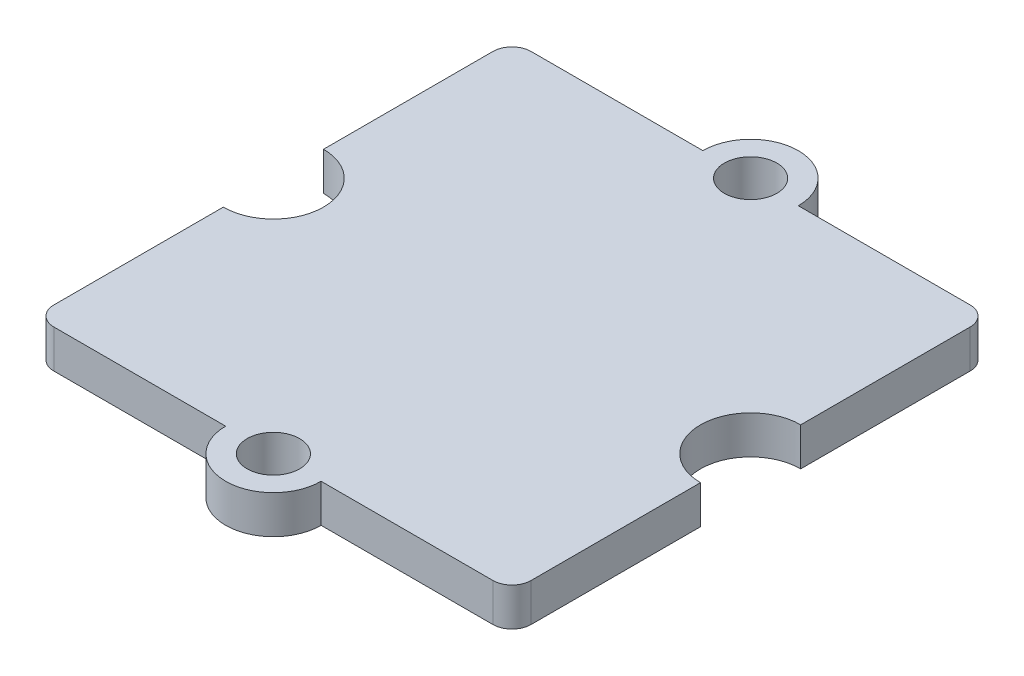
ISO-10303-21;
HEADER;
FILE_DESCRIPTION(('STEP AP214'),'2;1');
FILE_NAME('part.step','',(''),(''),'','','');
FILE_SCHEMA(('AUTOMOTIVE_DESIGN { 1 0 10303 214 1 1 1 1 }'));
ENDSEC;
DATA;
#1=APPLICATION_CONTEXT('core data for automotive mechanical design processes');
#2=APPLICATION_PROTOCOL_DEFINITION('international standard','automotive_design',2000,#1);
#3=PRODUCT_CONTEXT('',#1,'mechanical');
#4=PRODUCT('Part','Part','',(#3));
#5=PRODUCT_RELATED_PRODUCT_CATEGORY('part','',(#4));
#6=PRODUCT_DEFINITION_FORMATION('','',#4);
#7=PRODUCT_DEFINITION_CONTEXT('part definition',#1,'design');
#8=PRODUCT_DEFINITION('design','',#6,#7);
#9=PRODUCT_DEFINITION_SHAPE('','',#8);
#10=(LENGTH_UNIT() NAMED_UNIT(*) SI_UNIT(.MILLI.,.METRE.));
#11=(NAMED_UNIT(*) PLANE_ANGLE_UNIT() SI_UNIT($,.RADIAN.));
#12=(NAMED_UNIT(*) SI_UNIT($,.STERADIAN.) SOLID_ANGLE_UNIT());
#13=UNCERTAINTY_MEASURE_WITH_UNIT(LENGTH_MEASURE(1.E-05),#10,'distance_accuracy_value','');
#14=(GEOMETRIC_REPRESENTATION_CONTEXT(3) GLOBAL_UNCERTAINTY_ASSIGNED_CONTEXT((#13)) GLOBAL_UNIT_ASSIGNED_CONTEXT((#10,
#11,#12)) REPRESENTATION_CONTEXT('',''));
#15=CARTESIAN_POINT('',(0.,0.,0.));
#16=DIRECTION('',(0.,0.,1.));
#17=DIRECTION('',(1.,0.,0.));
#18=AXIS2_PLACEMENT_3D('',#15,#16,#17);
#19=CARTESIAN_POINT('',(0.,0.8,10.));
#20=DIRECTION('',(0.,-1.,0.));
#21=DIRECTION('',(0.,0.,-1.));
#22=AXIS2_PLACEMENT_3D('',#19,#20,#21);
#23=CYLINDRICAL_SURFACE('',#22,2.);
#24=CARTESIAN_POINT('',(0.,-0.8,10.));
#25=DIRECTION('',(0.,1.,0.));
#26=DIRECTION('',(0.,0.,1.));
#27=AXIS2_PLACEMENT_3D('',#24,#25,#26);
#28=CIRCLE('',#27,2.);
#29=CARTESIAN_POINT('',(-2.,-0.8,10.));
#30=VERTEX_POINT('',#29);
#31=CARTESIAN_POINT('',(2.,-0.8,10.));
#32=VERTEX_POINT('',#31);
#33=EDGE_CURVE('E191',#30,#32,#28,.T.);
#34=ORIENTED_EDGE('',*,*,#33,.T.);
#35=DIRECTION('',(0.,-1.,0.));
#36=VECTOR('',#35,1.);
#37=CARTESIAN_POINT('',(2.,0.8,10.));
#38=LINE('',#37,#36);
#39=CARTESIAN_POINT('',(2.,0.8,10.));
#40=VERTEX_POINT('',#39);
#41=EDGE_CURVE('E11',#40,#32,#38,.T.);
#42=ORIENTED_EDGE('',*,*,#41,.F.);
#43=CARTESIAN_POINT('',(0.,0.8,10.));
#44=DIRECTION('',(0.,1.,0.));
#45=DIRECTION('',(0.,0.,1.));
#46=AXIS2_PLACEMENT_3D('',#43,#44,#45);
#47=CIRCLE('',#46,2.);
#48=CARTESIAN_POINT('',(-2.,0.8,10.));
#49=VERTEX_POINT('',#48);
#50=EDGE_CURVE('E232',#49,#40,#47,.T.);
#51=ORIENTED_EDGE('',*,*,#50,.F.);
#52=DIRECTION('',(0.,-1.,0.));
#53=VECTOR('',#52,1.);
#54=CARTESIAN_POINT('',(-2.,0.8,10.));
#55=LINE('',#54,#53);
#56=EDGE_CURVE('E190',#49,#30,#55,.T.);
#57=ORIENTED_EDGE('',*,*,#56,.T.);
#58=EDGE_LOOP('',(#34,#42,#51,#57));
#59=FACE_BOUND('',#58,.T.);
#60=ADVANCED_FACE('F40',(#59),#23,.T.);
#61=CARTESIAN_POINT('',(0.,0.8,10.));
#62=DIRECTION('',(0.,0.,-1.));
#63=DIRECTION('',(-1.,0.,0.));
#64=AXIS2_PLACEMENT_3D('',#61,#62,#63);
#65=PLANE('',#64);
#66=DIRECTION('',(1.,0.,0.));
#67=VECTOR('',#66,1.);
#68=CARTESIAN_POINT('',(0.,-0.8,10.));
#69=LINE('',#68,#67);
#70=CARTESIAN_POINT('',(9.2,-0.8,10.));
#71=VERTEX_POINT('',#70);
#72=EDGE_CURVE('E194',#32,#71,#69,.T.);
#73=ORIENTED_EDGE('',*,*,#72,.T.);
#74=DIRECTION('',(0.,-1.,0.));
#75=VECTOR('',#74,1.);
#76=CARTESIAN_POINT('',(9.2,0.8,10.));
#77=LINE('',#76,#75);
#78=CARTESIAN_POINT('',(9.2,0.8,10.));
#79=VERTEX_POINT('',#78);
#80=EDGE_CURVE('E48',#79,#71,#77,.T.);
#81=ORIENTED_EDGE('',*,*,#80,.F.);
#82=DIRECTION('',(1.,0.,0.));
#83=VECTOR('',#82,1.);
#84=CARTESIAN_POINT('',(0.,0.8,10.));
#85=LINE('',#84,#83);
#86=EDGE_CURVE('E119',#40,#79,#85,.T.);
#87=ORIENTED_EDGE('',*,*,#86,.F.);
#88=ORIENTED_EDGE('',*,*,#41,.T.);
#89=EDGE_LOOP('',(#73,#81,#87,#88));
#90=FACE_BOUND('',#89,.T.);
#91=ADVANCED_FACE('F312',(#90),#65,.F.);
#92=CARTESIAN_POINT('',(9.2,0.8,9.2));
#93=DIRECTION('',(0.,-1.,0.));
#94=DIRECTION('',(0.,0.,-1.));
#95=AXIS2_PLACEMENT_3D('',#92,#93,#94);
#96=CYLINDRICAL_SURFACE('',#95,0.800000000000001);
#97=CARTESIAN_POINT('',(9.2,-0.8,9.2));
#98=DIRECTION('',(0.,1.,0.));
#99=DIRECTION('',(0.,0.,1.));
#100=AXIS2_PLACEMENT_3D('',#97,#98,#99);
#101=CIRCLE('',#100,0.800000000000001);
#102=CARTESIAN_POINT('',(10.,-0.8,9.2));
#103=VERTEX_POINT('',#102);
#104=EDGE_CURVE('E196',#71,#103,#101,.T.);
#105=ORIENTED_EDGE('',*,*,#104,.T.);
#106=DIRECTION('',(0.,-1.,0.));
#107=VECTOR('',#106,1.);
#108=CARTESIAN_POINT('',(10.,0.8,9.2));
#109=LINE('',#108,#107);
#110=CARTESIAN_POINT('',(10.,0.8,9.2));
#111=VERTEX_POINT('',#110);
#112=EDGE_CURVE('E254',#111,#103,#109,.T.);
#113=ORIENTED_EDGE('',*,*,#112,.F.);
#114=CARTESIAN_POINT('',(9.2,0.8,9.2));
#115=DIRECTION('',(0.,1.,0.));
#116=DIRECTION('',(0.,0.,1.));
#117=AXIS2_PLACEMENT_3D('',#114,#115,#116);
#118=CIRCLE('',#117,0.800000000000001);
#119=EDGE_CURVE('E262',#79,#111,#118,.T.);
#120=ORIENTED_EDGE('',*,*,#119,.F.);
#121=ORIENTED_EDGE('',*,*,#80,.T.);
#122=EDGE_LOOP('',(#105,#113,#120,#121));
#123=FACE_BOUND('',#122,.T.);
#124=ADVANCED_FACE('F260',(#123),#96,.T.);
#125=CARTESIAN_POINT('',(10.,0.8,0.));
#126=DIRECTION('',(-1.,0.,0.));
#127=DIRECTION('',(0.,0.,1.));
#128=AXIS2_PLACEMENT_3D('',#125,#126,#127);
#129=PLANE('',#128);
#130=DIRECTION('',(0.,0.,-1.));
#131=VECTOR('',#130,1.);
#132=CARTESIAN_POINT('',(10.,-0.8,0.));
#133=LINE('',#132,#131);
#134=CARTESIAN_POINT('',(10.,-0.8,2.10000000000001));
#135=VERTEX_POINT('',#134);
#136=EDGE_CURVE('E198',#103,#135,#133,.T.);
#137=ORIENTED_EDGE('',*,*,#136,.T.);
#138=DIRECTION('',(0.,-1.,0.));
#139=VECTOR('',#138,1.);
#140=CARTESIAN_POINT('',(10.,0.8,2.10000000000001));
#141=LINE('',#140,#139);
#142=CARTESIAN_POINT('',(10.,0.8,2.10000000000001));
#143=VERTEX_POINT('',#142);
#144=EDGE_CURVE('E252',#143,#135,#141,.T.);
#145=ORIENTED_EDGE('',*,*,#144,.F.);
#146=DIRECTION('',(0.,0.,-1.));
#147=VECTOR('',#146,1.);
#148=CARTESIAN_POINT('',(10.,0.8,0.));
#149=LINE('',#148,#147);
#150=EDGE_CURVE('E275',#111,#143,#149,.T.);
#151=ORIENTED_EDGE('',*,*,#150,.F.);
#152=ORIENTED_EDGE('',*,*,#112,.T.);
#153=EDGE_LOOP('',(#137,#145,#151,#152));
#154=FACE_BOUND('',#153,.T.);
#155=ADVANCED_FACE('F272',(#154),#129,.F.);
#156=CARTESIAN_POINT('',(10.,0.8,0.));
#157=DIRECTION('',(0.,-1.,0.));
#158=DIRECTION('',(0.,0.,-1.));
#159=AXIS2_PLACEMENT_3D('',#156,#157,#158);
#160=CYLINDRICAL_SURFACE('',#159,2.1);
#161=CARTESIAN_POINT('',(10.,-0.8,0.));
#162=DIRECTION('',(0.,1.,0.));
#163=DIRECTION('',(0.,0.,1.));
#164=AXIS2_PLACEMENT_3D('',#161,#162,#163);
#165=CIRCLE('',#164,2.1);
#166=CARTESIAN_POINT('',(10.,-0.8,-2.09999999999999));
#167=VERTEX_POINT('',#166);
#168=EDGE_CURVE('E201',#167,#135,#165,.T.);
#169=ORIENTED_EDGE('',*,*,#168,.F.);
#170=DIRECTION('',(0.,-1.,0.));
#171=VECTOR('',#170,1.);
#172=CARTESIAN_POINT('',(10.,0.8,-2.09999999999999));
#173=LINE('',#172,#171);
#174=CARTESIAN_POINT('',(10.,0.8,-2.09999999999999));
#175=VERTEX_POINT('',#174);
#176=EDGE_CURVE('E250',#175,#167,#173,.T.);
#177=ORIENTED_EDGE('',*,*,#176,.F.);
#178=CARTESIAN_POINT('',(10.,0.8,0.));
#179=DIRECTION('',(0.,1.,0.));
#180=DIRECTION('',(0.,0.,1.));
#181=AXIS2_PLACEMENT_3D('',#178,#179,#180);
#182=CIRCLE('',#181,2.1);
#183=EDGE_CURVE('E277',#175,#143,#182,.T.);
#184=ORIENTED_EDGE('',*,*,#183,.T.);
#185=ORIENTED_EDGE('',*,*,#144,.T.);
#186=EDGE_LOOP('',(#169,#177,#184,#185));
#187=FACE_BOUND('',#186,.T.);
#188=ADVANCED_FACE('F341',(#187),#160,.F.);
#189=CARTESIAN_POINT('',(10.,-0.8,-9.20000000000001));
#190=VERTEX_POINT('',#189);
#191=EDGE_CURVE('E202',#167,#190,#133,.T.);
#192=ORIENTED_EDGE('',*,*,#191,.T.);
#193=DIRECTION('',(0.,-1.,0.));
#194=VECTOR('',#193,1.);
#195=CARTESIAN_POINT('',(10.,0.8,-9.20000000000001));
#196=LINE('',#195,#194);
#197=CARTESIAN_POINT('',(10.,0.8,-9.20000000000001));
#198=VERTEX_POINT('',#197);
#199=EDGE_CURVE('E248',#198,#190,#196,.T.);
#200=ORIENTED_EDGE('',*,*,#199,.F.);
#201=EDGE_CURVE('E279',#175,#198,#149,.T.);
#202=ORIENTED_EDGE('',*,*,#201,.F.);
#203=ORIENTED_EDGE('',*,*,#176,.T.);
#204=EDGE_LOOP('',(#192,#200,#202,#203));
#205=FACE_BOUND('',#204,.T.);
#206=ADVANCED_FACE('F343',(#205),#129,.F.);
#207=CARTESIAN_POINT('',(9.2,0.8,-9.20000000000001));
#208=DIRECTION('',(0.,-1.,0.));
#209=DIRECTION('',(0.,0.,-1.));
#210=AXIS2_PLACEMENT_3D('',#207,#208,#209);
#211=CYLINDRICAL_SURFACE('',#210,0.800000000000002);
#212=CARTESIAN_POINT('',(9.2,-0.8,-9.20000000000001));
#213=DIRECTION('',(0.,1.,0.));
#214=DIRECTION('',(0.,0.,1.));
#215=AXIS2_PLACEMENT_3D('',#212,#213,#214);
#216=CIRCLE('',#215,0.800000000000002);
#217=CARTESIAN_POINT('',(9.2,-0.8,-10.));
#218=VERTEX_POINT('',#217);
#219=EDGE_CURVE('E205',#218,#190,#216,.F.);
#220=ORIENTED_EDGE('',*,*,#219,.F.);
#221=DIRECTION('',(0.,-1.,0.));
#222=VECTOR('',#221,1.);
#223=CARTESIAN_POINT('',(9.2,0.8,-10.));
#224=LINE('',#223,#222);
#225=CARTESIAN_POINT('',(9.2,0.8,-10.));
#226=VERTEX_POINT('',#225);
#227=EDGE_CURVE('E246',#226,#218,#224,.T.);
#228=ORIENTED_EDGE('',*,*,#227,.F.);
#229=CARTESIAN_POINT('',(9.2,0.8,-9.20000000000001));
#230=DIRECTION('',(0.,1.,0.));
#231=DIRECTION('',(0.,0.,1.));
#232=AXIS2_PLACEMENT_3D('',#229,#230,#231);
#233=CIRCLE('',#232,0.800000000000002);
#234=EDGE_CURVE('E282',#226,#198,#233,.F.);
#235=ORIENTED_EDGE('',*,*,#234,.T.);
#236=ORIENTED_EDGE('',*,*,#199,.T.);
#237=EDGE_LOOP('',(#220,#228,#235,#236));
#238=FACE_BOUND('',#237,.T.);
#239=ADVANCED_FACE('F356',(#238),#211,.T.);
#240=CARTESIAN_POINT('',(0.,0.8,-10.));
#241=DIRECTION('',(0.,0.,-1.));
#242=DIRECTION('',(-1.,0.,0.));
#243=AXIS2_PLACEMENT_3D('',#240,#241,#242);
#244=PLANE('',#243);
#245=DIRECTION('',(1.,0.,0.));
#246=VECTOR('',#245,1.);
#247=CARTESIAN_POINT('',(0.,-0.8,-10.));
#248=LINE('',#247,#246);
#249=CARTESIAN_POINT('',(2.,-0.8,-10.));
#250=VERTEX_POINT('',#249);
#251=EDGE_CURVE('E208',#250,#218,#248,.T.);
#252=ORIENTED_EDGE('',*,*,#251,.F.);
#253=DIRECTION('',(0.,-1.,0.));
#254=VECTOR('',#253,1.);
#255=CARTESIAN_POINT('',(2.,0.8,-10.));
#256=LINE('',#255,#254);
#257=CARTESIAN_POINT('',(2.,0.8,-10.));
#258=VERTEX_POINT('',#257);
#259=EDGE_CURVE('E244',#258,#250,#256,.T.);
#260=ORIENTED_EDGE('',*,*,#259,.F.);
#261=DIRECTION('',(1.,0.,0.));
#262=VECTOR('',#261,1.);
#263=CARTESIAN_POINT('',(0.,0.8,-10.));
#264=LINE('',#263,#262);
#265=EDGE_CURVE('E287',#258,#226,#264,.T.);
#266=ORIENTED_EDGE('',*,*,#265,.T.);
#267=ORIENTED_EDGE('',*,*,#227,.T.);
#268=EDGE_LOOP('',(#252,#260,#266,#267));
#269=FACE_BOUND('',#268,.T.);
#270=ADVANCED_FACE('F363',(#269),#244,.T.);
#271=CARTESIAN_POINT('',(0.,0.8,-9.99999999999999));
#272=DIRECTION('',(0.,-1.,0.));
#273=DIRECTION('',(0.,0.,-1.));
#274=AXIS2_PLACEMENT_3D('',#271,#272,#273);
#275=CYLINDRICAL_SURFACE('',#274,2.);
#276=CARTESIAN_POINT('',(0.,-0.8,-9.99999999999999));
#277=DIRECTION('',(0.,1.,0.));
#278=DIRECTION('',(0.,0.,1.));
#279=AXIS2_PLACEMENT_3D('',#276,#277,#278);
#280=CIRCLE('',#279,2.);
#281=CARTESIAN_POINT('',(-2.,-0.8,-10.));
#282=VERTEX_POINT('',#281);
#283=EDGE_CURVE('E211',#250,#282,#280,.T.);
#284=ORIENTED_EDGE('',*,*,#283,.T.);
#285=DIRECTION('',(0.,-1.,0.));
#286=VECTOR('',#285,1.);
#287=CARTESIAN_POINT('',(-2.,0.8,-10.));
#288=LINE('',#287,#286);
#289=CARTESIAN_POINT('',(-2.,0.8,-10.));
#290=VERTEX_POINT('',#289);
#291=EDGE_CURVE('E242',#290,#282,#288,.T.);
#292=ORIENTED_EDGE('',*,*,#291,.F.);
#293=CARTESIAN_POINT('',(0.,0.8,-9.99999999999999));
#294=DIRECTION('',(0.,1.,0.));
#295=DIRECTION('',(0.,0.,1.));
#296=AXIS2_PLACEMENT_3D('',#293,#294,#295);
#297=CIRCLE('',#296,2.);
#298=EDGE_CURVE('E291',#258,#290,#297,.T.);
#299=ORIENTED_EDGE('',*,*,#298,.F.);
#300=ORIENTED_EDGE('',*,*,#259,.T.);
#301=EDGE_LOOP('',(#284,#292,#299,#300));
#302=FACE_BOUND('',#301,.T.);
#303=ADVANCED_FACE('F370',(#302),#275,.T.);
#304=CARTESIAN_POINT('',(-9.2,-0.8,-10.));
#305=VERTEX_POINT('',#304);
#306=EDGE_CURVE('E212',#305,#282,#248,.T.);
#307=ORIENTED_EDGE('',*,*,#306,.F.);
#308=DIRECTION('',(0.,-1.,0.));
#309=VECTOR('',#308,1.);
#310=CARTESIAN_POINT('',(-9.2,0.8,-10.));
#311=LINE('',#310,#309);
#312=CARTESIAN_POINT('',(-9.2,0.8,-10.));
#313=VERTEX_POINT('',#312);
#314=EDGE_CURVE('E240',#313,#305,#311,.T.);
#315=ORIENTED_EDGE('',*,*,#314,.F.);
#316=EDGE_CURVE('E293',#313,#290,#264,.T.);
#317=ORIENTED_EDGE('',*,*,#316,.T.);
#318=ORIENTED_EDGE('',*,*,#291,.T.);
#319=EDGE_LOOP('',(#307,#315,#317,#318));
#320=FACE_BOUND('',#319,.T.);
#321=ADVANCED_FACE('F373',(#320),#244,.T.);
#322=CARTESIAN_POINT('',(-9.2,0.8,-9.20000000000001));
#323=DIRECTION('',(0.,-1.,0.));
#324=DIRECTION('',(0.,0.,-1.));
#325=AXIS2_PLACEMENT_3D('',#322,#323,#324);
#326=CYLINDRICAL_SURFACE('',#325,0.800000000000002);
#327=CARTESIAN_POINT('',(-9.2,-0.8,-9.20000000000001));
#328=DIRECTION('',(0.,1.,0.));
#329=DIRECTION('',(0.,0.,1.));
#330=AXIS2_PLACEMENT_3D('',#327,#328,#329);
#331=CIRCLE('',#330,0.800000000000002);
#332=CARTESIAN_POINT('',(-10.,-0.8,-9.20000000000001));
#333=VERTEX_POINT('',#332);
#334=EDGE_CURVE('E215',#333,#305,#331,.F.);
#335=ORIENTED_EDGE('',*,*,#334,.F.);
#336=DIRECTION('',(0.,-1.,0.));
#337=VECTOR('',#336,1.);
#338=CARTESIAN_POINT('',(-10.,0.8,-9.20000000000001));
#339=LINE('',#338,#337);
#340=CARTESIAN_POINT('',(-10.,0.8,-9.20000000000001));
#341=VERTEX_POINT('',#340);
#342=EDGE_CURVE('E238',#341,#333,#339,.T.);
#343=ORIENTED_EDGE('',*,*,#342,.F.);
#344=CARTESIAN_POINT('',(-9.2,0.8,-9.20000000000001));
#345=DIRECTION('',(0.,1.,0.));
#346=DIRECTION('',(0.,0.,1.));
#347=AXIS2_PLACEMENT_3D('',#344,#345,#346);
#348=CIRCLE('',#347,0.800000000000002);
#349=EDGE_CURVE('E296',#341,#313,#348,.F.);
#350=ORIENTED_EDGE('',*,*,#349,.T.);
#351=ORIENTED_EDGE('',*,*,#314,.T.);
#352=EDGE_LOOP('',(#335,#343,#350,#351));
#353=FACE_BOUND('',#352,.T.);
#354=ADVANCED_FACE('F386',(#353),#326,.T.);
#355=CARTESIAN_POINT('',(-10.,0.8,0.));
#356=DIRECTION('',(-1.,0.,0.));
#357=DIRECTION('',(0.,0.,1.));
#358=AXIS2_PLACEMENT_3D('',#355,#356,#357);
#359=PLANE('',#358);
#360=DIRECTION('',(0.,0.,-1.));
#361=VECTOR('',#360,1.);
#362=CARTESIAN_POINT('',(-10.,-0.8,0.));
#363=LINE('',#362,#361);
#364=CARTESIAN_POINT('',(-10.,-0.8,-2.09999999999999));
#365=VERTEX_POINT('',#364);
#366=EDGE_CURVE('E218',#365,#333,#363,.T.);
#367=ORIENTED_EDGE('',*,*,#366,.F.);
#368=DIRECTION('',(0.,-1.,0.));
#369=VECTOR('',#368,1.);
#370=CARTESIAN_POINT('',(-10.,0.8,-2.09999999999999));
#371=LINE('',#370,#369);
#372=CARTESIAN_POINT('',(-10.,0.8,-2.09999999999999));
#373=VERTEX_POINT('',#372);
#374=EDGE_CURVE('E236',#373,#365,#371,.T.);
#375=ORIENTED_EDGE('',*,*,#374,.F.);
#376=DIRECTION('',(0.,0.,-1.));
#377=VECTOR('',#376,1.);
#378=CARTESIAN_POINT('',(-10.,0.8,0.));
#379=LINE('',#378,#377);
#380=EDGE_CURVE('E178',#373,#341,#379,.T.);
#381=ORIENTED_EDGE('',*,*,#380,.T.);
#382=ORIENTED_EDGE('',*,*,#342,.T.);
#383=EDGE_LOOP('',(#367,#375,#381,#382));
#384=FACE_BOUND('',#383,.T.);
#385=ADVANCED_FACE('F393',(#384),#359,.T.);
#386=CARTESIAN_POINT('',(-10.,0.8,0.));
#387=DIRECTION('',(0.,-1.,0.));
#388=DIRECTION('',(0.,0.,-1.));
#389=AXIS2_PLACEMENT_3D('',#386,#387,#388);
#390=CYLINDRICAL_SURFACE('',#389,2.1);
#391=CARTESIAN_POINT('',(-10.,-0.8,0.));
#392=DIRECTION('',(0.,1.,0.));
#393=DIRECTION('',(0.,0.,1.));
#394=AXIS2_PLACEMENT_3D('',#391,#392,#393);
#395=CIRCLE('',#394,2.1);
#396=CARTESIAN_POINT('',(-10.,-0.8,2.10000000000001));
#397=VERTEX_POINT('',#396);
#398=EDGE_CURVE('E221',#397,#365,#395,.T.);
#399=ORIENTED_EDGE('',*,*,#398,.F.);
#400=DIRECTION('',(0.,-1.,0.));
#401=VECTOR('',#400,1.);
#402=CARTESIAN_POINT('',(-10.,0.8,2.10000000000001));
#403=LINE('',#402,#401);
#404=CARTESIAN_POINT('',(-10.,0.8,2.10000000000001));
#405=VERTEX_POINT('',#404);
#406=EDGE_CURVE('E168',#405,#397,#403,.T.);
#407=ORIENTED_EDGE('',*,*,#406,.F.);
#408=CARTESIAN_POINT('',(-10.,0.8,0.));
#409=DIRECTION('',(0.,1.,0.));
#410=DIRECTION('',(0.,0.,1.));
#411=AXIS2_PLACEMENT_3D('',#408,#409,#410);
#412=CIRCLE('',#411,2.1);
#413=EDGE_CURVE('E176',#405,#373,#412,.T.);
#414=ORIENTED_EDGE('',*,*,#413,.T.);
#415=ORIENTED_EDGE('',*,*,#374,.T.);
#416=EDGE_LOOP('',(#399,#407,#414,#415));
#417=FACE_BOUND('',#416,.T.);
#418=ADVANCED_FACE('F302',(#417),#390,.F.);
#419=CARTESIAN_POINT('',(-10.,-0.8,9.2));
#420=VERTEX_POINT('',#419);
#421=EDGE_CURVE('E163',#420,#397,#363,.T.);
#422=ORIENTED_EDGE('',*,*,#421,.F.);
#423=DIRECTION('',(0.,-1.,0.));
#424=VECTOR('',#423,1.);
#425=CARTESIAN_POINT('',(-10.,0.8,9.2));
#426=LINE('',#425,#424);
#427=CARTESIAN_POINT('',(-10.,0.8,9.2));
#428=VERTEX_POINT('',#427);
#429=EDGE_CURVE('E158',#428,#420,#426,.T.);
#430=ORIENTED_EDGE('',*,*,#429,.F.);
#431=EDGE_CURVE('E161',#428,#405,#379,.T.);
#432=ORIENTED_EDGE('',*,*,#431,.T.);
#433=ORIENTED_EDGE('',*,*,#406,.T.);
#434=EDGE_LOOP('',(#422,#430,#432,#433));
#435=FACE_BOUND('',#434,.T.);
#436=ADVANCED_FACE('F160',(#435),#359,.T.);
#437=CARTESIAN_POINT('',(-9.19999999999999,0.8,9.2));
#438=DIRECTION('',(0.,-1.,0.));
#439=DIRECTION('',(0.,0.,-1.));
#440=AXIS2_PLACEMENT_3D('',#437,#438,#439);
#441=CYLINDRICAL_SURFACE('',#440,0.800000000000001);
#442=CARTESIAN_POINT('',(-9.19999999999999,-0.8,9.2));
#443=DIRECTION('',(0.,1.,0.));
#444=DIRECTION('',(0.,0.,1.));
#445=AXIS2_PLACEMENT_3D('',#442,#443,#444);
#446=CIRCLE('',#445,0.800000000000001);
#447=CARTESIAN_POINT('',(-9.19999999999999,-0.8,10.));
#448=VERTEX_POINT('',#447);
#449=EDGE_CURVE('E224',#448,#420,#446,.F.);
#450=ORIENTED_EDGE('',*,*,#449,.F.);
#451=DIRECTION('',(0.,-1.,0.));
#452=VECTOR('',#451,1.);
#453=CARTESIAN_POINT('',(-9.19999999999999,0.8,10.));
#454=LINE('',#453,#452);
#455=CARTESIAN_POINT('',(-9.19999999999999,0.8,10.));
#456=VERTEX_POINT('',#455);
#457=EDGE_CURVE('E108',#456,#448,#454,.T.);
#458=ORIENTED_EDGE('',*,*,#457,.F.);
#459=CARTESIAN_POINT('',(-9.19999999999999,0.8,9.2));
#460=DIRECTION('',(0.,1.,0.));
#461=DIRECTION('',(0.,0.,1.));
#462=AXIS2_PLACEMENT_3D('',#459,#460,#461);
#463=CIRCLE('',#462,0.800000000000001);
#464=EDGE_CURVE('E173',#456,#428,#463,.F.);
#465=ORIENTED_EDGE('',*,*,#464,.T.);
#466=ORIENTED_EDGE('',*,*,#429,.T.);
#467=EDGE_LOOP('',(#450,#458,#465,#466));
#468=FACE_BOUND('',#467,.T.);
#469=ADVANCED_FACE('F179',(#468),#441,.T.);
#470=CARTESIAN_POINT('',(0.,0.8,-9.99999999999999));
#471=DIRECTION('',(0.,-1.,0.));
#472=DIRECTION('',(0.,0.,-1.));
#473=AXIS2_PLACEMENT_3D('',#470,#471,#472);
#474=CYLINDRICAL_SURFACE('',#473,1.1);
#475=CARTESIAN_POINT('',(0.,0.8,-9.99999999999999));
#476=DIRECTION('',(0.,1.,0.));
#477=DIRECTION('',(0.,0.,1.));
#478=AXIS2_PLACEMENT_3D('',#475,#476,#477);
#479=CIRCLE('',#478,1.1);
#480=CARTESIAN_POINT('',(0.,0.8,-8.9));
#481=VERTEX_POINT('',#480);
#482=EDGE_CURVE('E181',#481,#481,#479,.T.);
#483=ORIENTED_EDGE('',*,*,#482,.T.);
#484=EDGE_LOOP('',(#483));
#485=FACE_BOUND('',#484,.T.);
#486=CARTESIAN_POINT('',(0.,-0.8,-9.99999999999999));
#487=DIRECTION('',(0.,1.,0.));
#488=DIRECTION('',(0.,0.,1.));
#489=AXIS2_PLACEMENT_3D('',#486,#487,#488);
#490=CIRCLE('',#489,1.1);
#491=CARTESIAN_POINT('',(0.,-0.8,-8.9));
#492=VERTEX_POINT('',#491);
#493=EDGE_CURVE('E226',#492,#492,#490,.T.);
#494=ORIENTED_EDGE('',*,*,#493,.F.);
#495=EDGE_LOOP('',(#494));
#496=FACE_BOUND('',#495,.T.);
#497=ADVANCED_FACE('F310',(#485,#496),#474,.F.);
#498=EDGE_CURVE('E111',#448,#30,#69,.T.);
#499=ORIENTED_EDGE('',*,*,#498,.T.);
#500=ORIENTED_EDGE('',*,*,#56,.F.);
#501=EDGE_CURVE('E56',#456,#49,#85,.T.);
#502=ORIENTED_EDGE('',*,*,#501,.F.);
#503=ORIENTED_EDGE('',*,*,#457,.T.);
#504=EDGE_LOOP('',(#499,#500,#502,#503));
#505=FACE_BOUND('',#504,.T.);
#506=ADVANCED_FACE('F307',(#505),#65,.F.);
#507=CARTESIAN_POINT('',(0.,0.8,10.));
#508=DIRECTION('',(0.,-1.,0.));
#509=DIRECTION('',(0.,0.,-1.));
#510=AXIS2_PLACEMENT_3D('',#507,#508,#509);
#511=CYLINDRICAL_SURFACE('',#510,1.1);
#512=CARTESIAN_POINT('',(0.,0.8,10.));
#513=DIRECTION('',(0.,1.,0.));
#514=DIRECTION('',(0.,0.,1.));
#515=AXIS2_PLACEMENT_3D('',#512,#513,#514);
#516=CIRCLE('',#515,1.1);
#517=CARTESIAN_POINT('',(0.,0.8,11.1));
#518=VERTEX_POINT('',#517);
#519=EDGE_CURVE('E187',#518,#518,#516,.T.);
#520=ORIENTED_EDGE('',*,*,#519,.T.);
#521=EDGE_LOOP('',(#520));
#522=FACE_BOUND('',#521,.T.);
#523=CARTESIAN_POINT('',(0.,-0.8,10.));
#524=DIRECTION('',(0.,1.,0.));
#525=DIRECTION('',(0.,0.,1.));
#526=AXIS2_PLACEMENT_3D('',#523,#524,#525);
#527=CIRCLE('',#526,1.1);
#528=CARTESIAN_POINT('',(0.,-0.8,11.1));
#529=VERTEX_POINT('',#528);
#530=EDGE_CURVE('E229',#529,#529,#527,.T.);
#531=ORIENTED_EDGE('',*,*,#530,.F.);
#532=EDGE_LOOP('',(#531));
#533=FACE_BOUND('',#532,.T.);
#534=ADVANCED_FACE('F309',(#522,#533),#511,.F.);
#535=CARTESIAN_POINT('',(0.,0.8,0.));
#536=DIRECTION('',(0.,1.,0.));
#537=DIRECTION('',(0.,0.,1.));
#538=AXIS2_PLACEMENT_3D('',#535,#536,#537);
#539=PLANE('',#538);
#540=ORIENTED_EDGE('',*,*,#50,.T.);
#541=ORIENTED_EDGE('',*,*,#86,.T.);
#542=ORIENTED_EDGE('',*,*,#119,.T.);
#543=ORIENTED_EDGE('',*,*,#150,.T.);
#544=ORIENTED_EDGE('',*,*,#183,.F.);
#545=ORIENTED_EDGE('',*,*,#201,.T.);
#546=ORIENTED_EDGE('',*,*,#234,.F.);
#547=ORIENTED_EDGE('',*,*,#265,.F.);
#548=ORIENTED_EDGE('',*,*,#298,.T.);
#549=ORIENTED_EDGE('',*,*,#316,.F.);
#550=ORIENTED_EDGE('',*,*,#349,.F.);
#551=ORIENTED_EDGE('',*,*,#380,.F.);
#552=ORIENTED_EDGE('',*,*,#413,.F.);
#553=ORIENTED_EDGE('',*,*,#431,.F.);
#554=ORIENTED_EDGE('',*,*,#464,.F.);
#555=ORIENTED_EDGE('',*,*,#501,.T.);
#556=EDGE_LOOP('',(#540,#541,#542,#543,#544,#545,#546,#547,#548,#549,#550,#551,#552,#553,#554,#555));
#557=FACE_BOUND('',#556,.T.);
#558=ORIENTED_EDGE('',*,*,#482,.F.);
#559=EDGE_LOOP('',(#558));
#560=FACE_BOUND('',#559,.T.);
#561=ORIENTED_EDGE('',*,*,#519,.F.);
#562=EDGE_LOOP('',(#561));
#563=FACE_BOUND('',#562,.T.);
#564=ADVANCED_FACE('F171',(#557,#560,#563),#539,.T.);
#565=CARTESIAN_POINT('',(0.,-0.8,0.));
#566=DIRECTION('',(0.,1.,0.));
#567=DIRECTION('',(0.,0.,1.));
#568=AXIS2_PLACEMENT_3D('',#565,#566,#567);
#569=PLANE('',#568);
#570=ORIENTED_EDGE('',*,*,#33,.F.);
#571=ORIENTED_EDGE('',*,*,#498,.F.);
#572=ORIENTED_EDGE('',*,*,#449,.T.);
#573=ORIENTED_EDGE('',*,*,#421,.T.);
#574=ORIENTED_EDGE('',*,*,#398,.T.);
#575=ORIENTED_EDGE('',*,*,#366,.T.);
#576=ORIENTED_EDGE('',*,*,#334,.T.);
#577=ORIENTED_EDGE('',*,*,#306,.T.);
#578=ORIENTED_EDGE('',*,*,#283,.F.);
#579=ORIENTED_EDGE('',*,*,#251,.T.);
#580=ORIENTED_EDGE('',*,*,#219,.T.);
#581=ORIENTED_EDGE('',*,*,#191,.F.);
#582=ORIENTED_EDGE('',*,*,#168,.T.);
#583=ORIENTED_EDGE('',*,*,#136,.F.);
#584=ORIENTED_EDGE('',*,*,#104,.F.);
#585=ORIENTED_EDGE('',*,*,#72,.F.);
#586=EDGE_LOOP('',(#570,#571,#572,#573,#574,#575,#576,#577,#578,#579,#580,#581,#582,#583,#584,#585));
#587=FACE_BOUND('',#586,.T.);
#588=ORIENTED_EDGE('',*,*,#493,.T.);
#589=EDGE_LOOP('',(#588));
#590=FACE_BOUND('',#589,.T.);
#591=ORIENTED_EDGE('',*,*,#530,.T.);
#592=EDGE_LOOP('',(#591));
#593=FACE_BOUND('',#592,.T.);
#594=ADVANCED_FACE('F266',(#587,#590,#593),#569,.F.);
#595=CLOSED_SHELL('',(#60,#91,#124,#155,#188,#206,#239,#270,#303,#321,#354,#385,#418,#436,#469,
#497,#506,#534,#564,#594));
#596=MANIFOLD_SOLID_BREP('B2',#595);
#597=ADVANCED_BREP_SHAPE_REPRESENTATION('',(#18,#596),#14);
#598=SHAPE_DEFINITION_REPRESENTATION(#9,#597);
ENDSEC;
END-ISO-10303-21;
